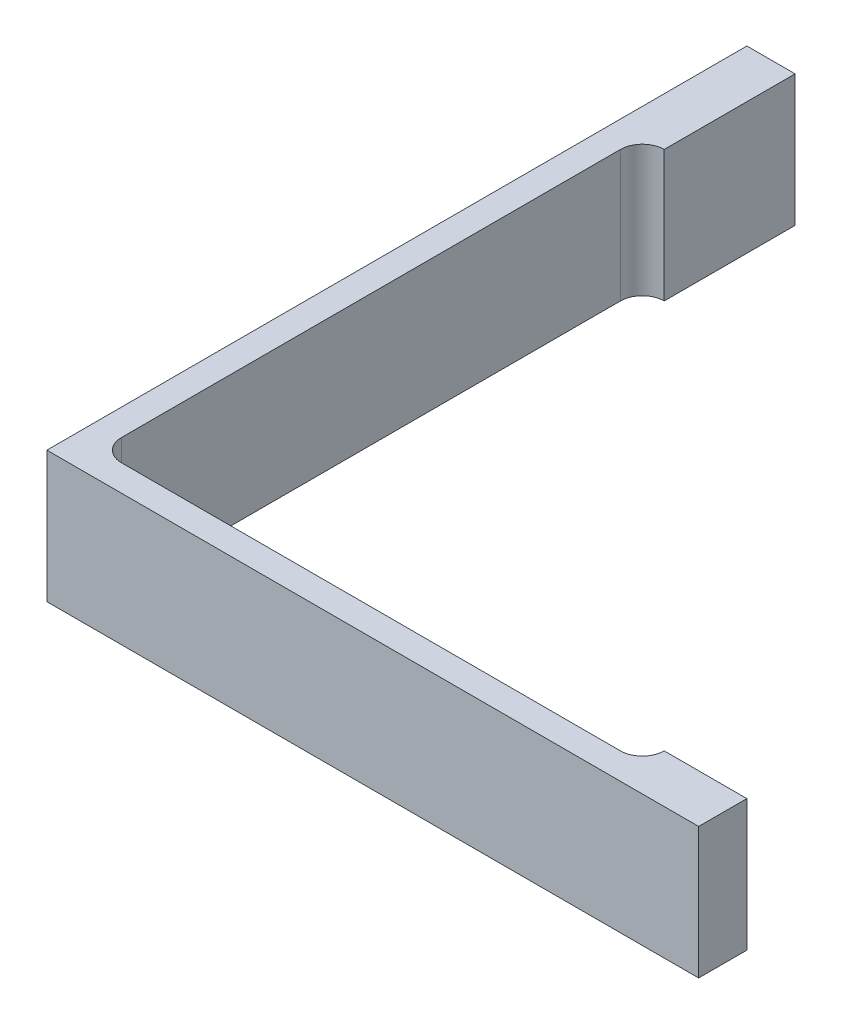
ISO-10303-21;
HEADER;
FILE_DESCRIPTION(('STEP AP214'),'2;1');
FILE_NAME('part.step','',(''),(''),'','','');
FILE_SCHEMA(('AUTOMOTIVE_DESIGN { 1 0 10303 214 1 1 1 1 }'));
ENDSEC;
DATA;
#1=APPLICATION_CONTEXT('core data for automotive mechanical design processes');
#2=APPLICATION_PROTOCOL_DEFINITION('international standard','automotive_design',2000,#1);
#3=PRODUCT_CONTEXT('',#1,'mechanical');
#4=PRODUCT('Part','Part','',(#3));
#5=PRODUCT_RELATED_PRODUCT_CATEGORY('part','',(#4));
#6=PRODUCT_DEFINITION_FORMATION('','',#4);
#7=PRODUCT_DEFINITION_CONTEXT('part definition',#1,'design');
#8=PRODUCT_DEFINITION('design','',#6,#7);
#9=PRODUCT_DEFINITION_SHAPE('','',#8);
#10=(LENGTH_UNIT() NAMED_UNIT(*) SI_UNIT(.MILLI.,.METRE.));
#11=(NAMED_UNIT(*) PLANE_ANGLE_UNIT() SI_UNIT($,.RADIAN.));
#12=(NAMED_UNIT(*) SI_UNIT($,.STERADIAN.) SOLID_ANGLE_UNIT());
#13=UNCERTAINTY_MEASURE_WITH_UNIT(LENGTH_MEASURE(1.E-05),#10,'distance_accuracy_value','');
#14=(GEOMETRIC_REPRESENTATION_CONTEXT(3) GLOBAL_UNCERTAINTY_ASSIGNED_CONTEXT((#13)) GLOBAL_UNIT_ASSIGNED_CONTEXT((#10,
#11,#12)) REPRESENTATION_CONTEXT('',''));
#15=CARTESIAN_POINT('',(0.,0.,0.));
#16=DIRECTION('',(0.,0.,1.));
#17=DIRECTION('',(1.,0.,0.));
#18=AXIS2_PLACEMENT_3D('',#15,#16,#17);
#19=CARTESIAN_POINT('',(47.3,9.525,0.));
#20=DIRECTION('',(0.,0.,-1.));
#21=DIRECTION('',(-1.,0.,0.));
#22=AXIS2_PLACEMENT_3D('',#19,#20,#21);
#23=PLANE('',#22);
#24=DIRECTION('',(1.,0.,0.));
#25=VECTOR('',#24,1.);
#26=CARTESIAN_POINT('',(47.3,0.,0.));
#27=LINE('',#26,#25);
#28=CARTESIAN_POINT('',(0.,0.,0.));
#29=VERTEX_POINT('',#28);
#30=CARTESIAN_POINT('',(47.3,0.,0.));
#31=VERTEX_POINT('',#30);
#32=EDGE_CURVE('E166',#29,#31,#27,.T.);
#33=ORIENTED_EDGE('',*,*,#32,.T.);
#34=DIRECTION('',(0.,-1.,0.));
#35=VECTOR('',#34,1.);
#36=CARTESIAN_POINT('',(47.3,9.525,0.));
#37=LINE('',#36,#35);
#38=CARTESIAN_POINT('',(47.3,9.525,0.));
#39=VERTEX_POINT('',#38);
#40=EDGE_CURVE('E200',#39,#31,#37,.T.);
#41=ORIENTED_EDGE('',*,*,#40,.F.);
#42=DIRECTION('',(1.,0.,0.));
#43=VECTOR('',#42,1.);
#44=CARTESIAN_POINT('',(47.3,9.525,0.));
#45=LINE('',#44,#43);
#46=CARTESIAN_POINT('',(0.,9.525,0.));
#47=VERTEX_POINT('',#46);
#48=EDGE_CURVE('E168',#47,#39,#45,.T.);
#49=ORIENTED_EDGE('',*,*,#48,.F.);
#50=DIRECTION('',(0.,-1.,0.));
#51=VECTOR('',#50,1.);
#52=CARTESIAN_POINT('',(0.,9.525,0.));
#53=LINE('',#52,#51);
#54=EDGE_CURVE('E181',#47,#29,#53,.T.);
#55=ORIENTED_EDGE('',*,*,#54,.T.);
#56=EDGE_LOOP('',(#33,#41,#49,#55));
#57=FACE_BOUND('',#56,.T.);
#58=ADVANCED_FACE('F34',(#57),#23,.F.);
#59=CARTESIAN_POINT('',(47.3,9.525,0.));
#60=DIRECTION('',(-1.,0.,0.));
#61=DIRECTION('',(0.,0.,1.));
#62=AXIS2_PLACEMENT_3D('',#59,#60,#61);
#63=PLANE('',#62);
#64=DIRECTION('',(0.,0.,-1.));
#65=VECTOR('',#64,1.);
#66=CARTESIAN_POINT('',(47.3,0.,0.));
#67=LINE('',#66,#65);
#68=CARTESIAN_POINT('',(47.3,0.,-3.49999999999999));
#69=VERTEX_POINT('',#68);
#70=EDGE_CURVE('E184',#31,#69,#67,.T.);
#71=ORIENTED_EDGE('',*,*,#70,.T.);
#72=DIRECTION('',(0.,-1.,0.));
#73=VECTOR('',#72,1.);
#74=CARTESIAN_POINT('',(47.3,9.525,-3.49999999999999));
#75=LINE('',#74,#73);
#76=CARTESIAN_POINT('',(47.3,9.525,-3.49999999999999));
#77=VERTEX_POINT('',#76);
#78=EDGE_CURVE('E197',#77,#69,#75,.T.);
#79=ORIENTED_EDGE('',*,*,#78,.F.);
#80=DIRECTION('',(0.,0.,-1.));
#81=VECTOR('',#80,1.);
#82=CARTESIAN_POINT('',(47.3,9.525,0.));
#83=LINE('',#82,#81);
#84=EDGE_CURVE('E171',#39,#77,#83,.T.);
#85=ORIENTED_EDGE('',*,*,#84,.F.);
#86=ORIENTED_EDGE('',*,*,#40,.T.);
#87=EDGE_LOOP('',(#71,#79,#85,#86));
#88=FACE_BOUND('',#87,.T.);
#89=ADVANCED_FACE('F229',(#88),#63,.F.);
#90=CARTESIAN_POINT('',(3.50000000000001,9.525,-3.49999999999999));
#91=DIRECTION('',(0.,0.,1.));
#92=DIRECTION('',(1.,0.,0.));
#93=AXIS2_PLACEMENT_3D('',#90,#91,#92);
#94=PLANE('',#93);
#95=DIRECTION('',(-1.,0.,0.));
#96=VECTOR('',#95,1.);
#97=CARTESIAN_POINT('',(3.50000000000001,0.,-3.49999999999999));
#98=LINE('',#97,#96);
#99=CARTESIAN_POINT('',(41.3,0.,-3.49999999999999));
#100=VERTEX_POINT('',#99);
#101=EDGE_CURVE('E132',#69,#100,#98,.T.);
#102=ORIENTED_EDGE('',*,*,#101,.T.);
#103=DIRECTION('',(0.,1.,0.));
#104=VECTOR('',#103,1.);
#105=CARTESIAN_POINT('',(41.3,0.,-3.49999999999999));
#106=LINE('',#105,#104);
#107=CARTESIAN_POINT('',(41.3,9.525,-3.49999999999999));
#108=VERTEX_POINT('',#107);
#109=EDGE_CURVE('E124',#100,#108,#106,.T.);
#110=ORIENTED_EDGE('',*,*,#109,.T.);
#111=DIRECTION('',(-1.,0.,0.));
#112=VECTOR('',#111,1.);
#113=CARTESIAN_POINT('',(3.50000000000001,9.525,-3.49999999999999));
#114=LINE('',#113,#112);
#115=EDGE_CURVE('E174',#77,#108,#114,.T.);
#116=ORIENTED_EDGE('',*,*,#115,.F.);
#117=ORIENTED_EDGE('',*,*,#78,.T.);
#118=EDGE_LOOP('',(#102,#110,#116,#117));
#119=FACE_BOUND('',#118,.T.);
#120=ADVANCED_FACE('F216',(#119),#94,.F.);
#121=CARTESIAN_POINT('',(3.5,9.525,-50.8));
#122=DIRECTION('',(-1.,0.,0.));
#123=DIRECTION('',(0.,0.,1.));
#124=AXIS2_PLACEMENT_3D('',#121,#122,#123);
#125=PLANE('',#124);
#126=DIRECTION('',(0.,0.,-1.));
#127=VECTOR('',#126,1.);
#128=CARTESIAN_POINT('',(3.5,9.525,-50.8));
#129=LINE('',#128,#127);
#130=CARTESIAN_POINT('',(3.50000000000001,9.525,-41.3));
#131=VERTEX_POINT('',#130);
#132=CARTESIAN_POINT('',(3.5,9.525,-50.8));
#133=VERTEX_POINT('',#132);
#134=EDGE_CURVE('E122',#131,#133,#129,.T.);
#135=ORIENTED_EDGE('',*,*,#134,.F.);
#136=DIRECTION('',(0.,1.,0.));
#137=VECTOR('',#136,1.);
#138=CARTESIAN_POINT('',(3.50000000000001,0.,-41.3));
#139=LINE('',#138,#137);
#140=CARTESIAN_POINT('',(3.50000000000001,0.,-41.3));
#141=VERTEX_POINT('',#140);
#142=EDGE_CURVE('E117',#141,#131,#139,.T.);
#143=ORIENTED_EDGE('',*,*,#142,.F.);
#144=DIRECTION('',(0.,0.,-1.));
#145=VECTOR('',#144,1.);
#146=CARTESIAN_POINT('',(3.5,0.,-50.8));
#147=LINE('',#146,#145);
#148=CARTESIAN_POINT('',(3.5,0.,-50.8));
#149=VERTEX_POINT('',#148);
#150=EDGE_CURVE('E120',#141,#149,#147,.T.);
#151=ORIENTED_EDGE('',*,*,#150,.T.);
#152=DIRECTION('',(0.,-1.,0.));
#153=VECTOR('',#152,1.);
#154=CARTESIAN_POINT('',(3.5,9.525,-50.8));
#155=LINE('',#154,#153);
#156=EDGE_CURVE('E195',#133,#149,#155,.T.);
#157=ORIENTED_EDGE('',*,*,#156,.F.);
#158=EDGE_LOOP('',(#135,#143,#151,#157));
#159=FACE_BOUND('',#158,.T.);
#160=ADVANCED_FACE('F118',(#159),#125,.F.);
#161=CARTESIAN_POINT('',(0.,9.525,-50.8));
#162=DIRECTION('',(0.,0.,1.));
#163=DIRECTION('',(1.,0.,0.));
#164=AXIS2_PLACEMENT_3D('',#161,#162,#163);
#165=PLANE('',#164);
#166=DIRECTION('',(-1.,0.,0.));
#167=VECTOR('',#166,1.);
#168=CARTESIAN_POINT('',(0.,0.,-50.8));
#169=LINE('',#168,#167);
#170=CARTESIAN_POINT('',(0.,0.,-50.8));
#171=VERTEX_POINT('',#170);
#172=EDGE_CURVE('E131',#149,#171,#169,.T.);
#173=ORIENTED_EDGE('',*,*,#172,.T.);
#174=DIRECTION('',(0.,-1.,0.));
#175=VECTOR('',#174,1.);
#176=CARTESIAN_POINT('',(0.,9.525,-50.8));
#177=LINE('',#176,#175);
#178=CARTESIAN_POINT('',(0.,9.525,-50.8));
#179=VERTEX_POINT('',#178);
#180=EDGE_CURVE('E192',#179,#171,#177,.T.);
#181=ORIENTED_EDGE('',*,*,#180,.F.);
#182=DIRECTION('',(-1.,0.,0.));
#183=VECTOR('',#182,1.);
#184=CARTESIAN_POINT('',(0.,9.525,-50.8));
#185=LINE('',#184,#183);
#186=EDGE_CURVE('E177',#133,#179,#185,.T.);
#187=ORIENTED_EDGE('',*,*,#186,.F.);
#188=ORIENTED_EDGE('',*,*,#156,.T.);
#189=EDGE_LOOP('',(#173,#181,#187,#188));
#190=FACE_BOUND('',#189,.T.);
#191=ADVANCED_FACE('F242',(#190),#165,.F.);
#192=CARTESIAN_POINT('',(0.,9.525,0.));
#193=DIRECTION('',(1.,0.,0.));
#194=DIRECTION('',(0.,0.,-1.));
#195=AXIS2_PLACEMENT_3D('',#192,#193,#194);
#196=PLANE('',#195);
#197=DIRECTION('',(0.,0.,1.));
#198=VECTOR('',#197,1.);
#199=CARTESIAN_POINT('',(0.,0.,0.));
#200=LINE('',#199,#198);
#201=EDGE_CURVE('E172',#171,#29,#200,.T.);
#202=ORIENTED_EDGE('',*,*,#201,.T.);
#203=ORIENTED_EDGE('',*,*,#54,.F.);
#204=DIRECTION('',(0.,0.,1.));
#205=VECTOR('',#204,1.);
#206=CARTESIAN_POINT('',(0.,9.525,0.));
#207=LINE('',#206,#205);
#208=EDGE_CURVE('E179',#179,#47,#207,.T.);
#209=ORIENTED_EDGE('',*,*,#208,.F.);
#210=ORIENTED_EDGE('',*,*,#180,.T.);
#211=EDGE_LOOP('',(#202,#203,#209,#210));
#212=FACE_BOUND('',#211,.T.);
#213=ADVANCED_FACE('F245',(#212),#196,.F.);
#214=CARTESIAN_POINT('',(0.,9.525,0.));
#215=DIRECTION('',(0.,-1.,0.));
#216=DIRECTION('',(0.,0.,-1.));
#217=AXIS2_PLACEMENT_3D('',#214,#215,#216);
#218=PLANE('',#217);
#219=ORIENTED_EDGE('',*,*,#115,.T.);
#220=CARTESIAN_POINT('',(39.7125,9.525,-3.49999999999999));
#221=DIRECTION('',(0.,-1.,0.));
#222=DIRECTION('',(0.,0.,-1.));
#223=AXIS2_PLACEMENT_3D('',#220,#221,#222);
#224=CIRCLE('',#223,1.5875);
#225=CARTESIAN_POINT('',(39.7125,9.525,-1.91249999999999));
#226=VERTEX_POINT('',#225);
#227=EDGE_CURVE('E140',#108,#226,#224,.T.);
#228=ORIENTED_EDGE('',*,*,#227,.T.);
#229=DIRECTION('',(1.,0.,0.));
#230=VECTOR('',#229,1.);
#231=CARTESIAN_POINT('',(1.91250000000001,9.525,-1.91249999999999));
#232=LINE('',#231,#230);
#233=CARTESIAN_POINT('',(3.5,9.525,-1.91249999999999));
#234=VERTEX_POINT('',#233);
#235=EDGE_CURVE('E157',#234,#226,#232,.T.);
#236=ORIENTED_EDGE('',*,*,#235,.F.);
#237=CARTESIAN_POINT('',(3.5,9.525,-3.49999999999999));
#238=DIRECTION('',(0.,-1.,0.));
#239=DIRECTION('',(0.,0.,-1.));
#240=AXIS2_PLACEMENT_3D('',#237,#238,#239);
#241=CIRCLE('',#240,1.5875);
#242=CARTESIAN_POINT('',(1.91250000000001,9.525,-3.49999999999999));
#243=VERTEX_POINT('',#242);
#244=EDGE_CURVE('E149',#234,#243,#241,.T.);
#245=ORIENTED_EDGE('',*,*,#244,.T.);
#246=DIRECTION('',(0.,0.,1.));
#247=VECTOR('',#246,1.);
#248=CARTESIAN_POINT('',(1.91250000000001,9.525,-3.5));
#249=LINE('',#248,#247);
#250=CARTESIAN_POINT('',(1.91250000000001,9.525,-39.7125));
#251=VERTEX_POINT('',#250);
#252=EDGE_CURVE('E155',#251,#243,#249,.T.);
#253=ORIENTED_EDGE('',*,*,#252,.F.);
#254=CARTESIAN_POINT('',(3.5,9.525,-39.7125));
#255=DIRECTION('',(0.,-1.,0.));
#256=DIRECTION('',(0.,0.,-1.));
#257=AXIS2_PLACEMENT_3D('',#254,#255,#256);
#258=CIRCLE('',#257,1.5875);
#259=EDGE_CURVE('E42',#251,#131,#258,.T.);
#260=ORIENTED_EDGE('',*,*,#259,.T.);
#261=ORIENTED_EDGE('',*,*,#134,.T.);
#262=ORIENTED_EDGE('',*,*,#186,.T.);
#263=ORIENTED_EDGE('',*,*,#208,.T.);
#264=ORIENTED_EDGE('',*,*,#48,.T.);
#265=ORIENTED_EDGE('',*,*,#84,.T.);
#266=EDGE_LOOP('',(#219,#228,#236,#245,#253,#260,#261,#262,#263,#264,#265));
#267=FACE_BOUND('',#266,.T.);
#268=ADVANCED_FACE('F154',(#267),#218,.F.);
#269=CARTESIAN_POINT('',(0.,0.,0.));
#270=DIRECTION('',(0.,-1.,0.));
#271=DIRECTION('',(0.,0.,-1.));
#272=AXIS2_PLACEMENT_3D('',#269,#270,#271);
#273=PLANE('',#272);
#274=DIRECTION('',(1.,0.,0.));
#275=VECTOR('',#274,1.);
#276=CARTESIAN_POINT('',(1.91250000000001,0.,-1.91249999999999));
#277=LINE('',#276,#275);
#278=CARTESIAN_POINT('',(3.5,0.,-1.91249999999999));
#279=VERTEX_POINT('',#278);
#280=CARTESIAN_POINT('',(39.7125,0.,-1.91249999999999));
#281=VERTEX_POINT('',#280);
#282=EDGE_CURVE('E125',#279,#281,#277,.T.);
#283=ORIENTED_EDGE('',*,*,#282,.T.);
#284=CARTESIAN_POINT('',(39.7125,0.,-3.49999999999999));
#285=DIRECTION('',(0.,-1.,0.));
#286=DIRECTION('',(0.,0.,-1.));
#287=AXIS2_PLACEMENT_3D('',#284,#285,#286);
#288=CIRCLE('',#287,1.5875);
#289=EDGE_CURVE('E147',#281,#100,#288,.F.);
#290=ORIENTED_EDGE('',*,*,#289,.T.);
#291=ORIENTED_EDGE('',*,*,#101,.F.);
#292=ORIENTED_EDGE('',*,*,#70,.F.);
#293=ORIENTED_EDGE('',*,*,#32,.F.);
#294=ORIENTED_EDGE('',*,*,#201,.F.);
#295=ORIENTED_EDGE('',*,*,#172,.F.);
#296=ORIENTED_EDGE('',*,*,#150,.F.);
#297=CARTESIAN_POINT('',(3.5,0.,-39.7125));
#298=DIRECTION('',(0.,-1.,0.));
#299=DIRECTION('',(0.,0.,-1.));
#300=AXIS2_PLACEMENT_3D('',#297,#298,#299);
#301=CIRCLE('',#300,1.5875);
#302=CARTESIAN_POINT('',(1.91250000000001,0.,-39.7125));
#303=VERTEX_POINT('',#302);
#304=EDGE_CURVE('E11',#141,#303,#301,.F.);
#305=ORIENTED_EDGE('',*,*,#304,.T.);
#306=DIRECTION('',(0.,0.,1.));
#307=VECTOR('',#306,1.);
#308=CARTESIAN_POINT('',(1.91250000000001,0.,-41.3));
#309=LINE('',#308,#307);
#310=CARTESIAN_POINT('',(1.91250000000001,0.,-3.5));
#311=VERTEX_POINT('',#310);
#312=EDGE_CURVE('E160',#303,#311,#309,.T.);
#313=ORIENTED_EDGE('',*,*,#312,.T.);
#314=CARTESIAN_POINT('',(3.5,0.,-3.49999999999999));
#315=DIRECTION('',(0.,-1.,0.));
#316=DIRECTION('',(0.,0.,-1.));
#317=AXIS2_PLACEMENT_3D('',#314,#315,#316);
#318=CIRCLE('',#317,1.5875);
#319=EDGE_CURVE('E151',#311,#279,#318,.F.);
#320=ORIENTED_EDGE('',*,*,#319,.T.);
#321=EDGE_LOOP('',(#283,#290,#291,#292,#293,#294,#295,#296,#305,#313,#320));
#322=FACE_BOUND('',#321,.T.);
#323=ADVANCED_FACE('F129',(#322),#273,.T.);
#324=CARTESIAN_POINT('',(1.91250000000001,0.,-1.91249999999999));
#325=DIRECTION('',(0.,0.,1.));
#326=DIRECTION('',(1.,0.,0.));
#327=AXIS2_PLACEMENT_3D('',#324,#325,#326);
#328=PLANE('',#327);
#329=ORIENTED_EDGE('',*,*,#235,.T.);
#330=DIRECTION('',(0.,1.,0.));
#331=VECTOR('',#330,1.);
#332=CARTESIAN_POINT('',(39.7125,0.,-1.91249999999999));
#333=LINE('',#332,#331);
#334=EDGE_CURVE('E138',#226,#281,#333,.F.);
#335=ORIENTED_EDGE('',*,*,#334,.T.);
#336=ORIENTED_EDGE('',*,*,#282,.F.);
#337=DIRECTION('',(0.,1.,0.));
#338=VECTOR('',#337,1.);
#339=CARTESIAN_POINT('',(3.5,9.525,-1.9125));
#340=LINE('',#339,#338);
#341=EDGE_CURVE('E142',#279,#234,#340,.T.);
#342=ORIENTED_EDGE('',*,*,#341,.T.);
#343=EDGE_LOOP('',(#329,#335,#336,#342));
#344=FACE_BOUND('',#343,.T.);
#345=ADVANCED_FACE('F206',(#344),#328,.F.);
#346=CARTESIAN_POINT('',(1.91250000000001,0.,-3.5));
#347=DIRECTION('',(-1.,0.,0.));
#348=DIRECTION('',(0.,0.,1.));
#349=AXIS2_PLACEMENT_3D('',#346,#347,#348);
#350=PLANE('',#349);
#351=ORIENTED_EDGE('',*,*,#252,.T.);
#352=DIRECTION('',(0.,1.,0.));
#353=VECTOR('',#352,1.);
#354=CARTESIAN_POINT('',(1.91250000000001,0.,-3.49999999999999));
#355=LINE('',#354,#353);
#356=EDGE_CURVE('E49',#243,#311,#355,.F.);
#357=ORIENTED_EDGE('',*,*,#356,.T.);
#358=ORIENTED_EDGE('',*,*,#312,.F.);
#359=DIRECTION('',(0.,1.,0.));
#360=VECTOR('',#359,1.);
#361=CARTESIAN_POINT('',(1.91250000000001,9.525,-39.7125));
#362=LINE('',#361,#360);
#363=EDGE_CURVE('E136',#303,#251,#362,.T.);
#364=ORIENTED_EDGE('',*,*,#363,.T.);
#365=EDGE_LOOP('',(#351,#357,#358,#364));
#366=FACE_BOUND('',#365,.T.);
#367=ADVANCED_FACE('F226',(#366),#350,.F.);
#368=CARTESIAN_POINT('',(39.7125,0.,-3.49999999999999));
#369=DIRECTION('',(0.,-1.,0.));
#370=DIRECTION('',(0.,0.,-1.));
#371=AXIS2_PLACEMENT_3D('',#368,#369,#370);
#372=CYLINDRICAL_SURFACE('',#371,1.5875);
#373=ORIENTED_EDGE('',*,*,#289,.F.);
#374=ORIENTED_EDGE('',*,*,#334,.F.);
#375=ORIENTED_EDGE('',*,*,#227,.F.);
#376=ORIENTED_EDGE('',*,*,#109,.F.);
#377=EDGE_LOOP('',(#373,#374,#375,#376));
#378=FACE_BOUND('',#377,.T.);
#379=ADVANCED_FACE('F214',(#378),#372,.F.);
#380=CARTESIAN_POINT('',(3.5,0.,-3.49999999999999));
#381=DIRECTION('',(0.,-1.,0.));
#382=DIRECTION('',(0.,0.,-1.));
#383=AXIS2_PLACEMENT_3D('',#380,#381,#382);
#384=CYLINDRICAL_SURFACE('',#383,1.5875);
#385=ORIENTED_EDGE('',*,*,#319,.F.);
#386=ORIENTED_EDGE('',*,*,#356,.F.);
#387=ORIENTED_EDGE('',*,*,#244,.F.);
#388=ORIENTED_EDGE('',*,*,#341,.F.);
#389=EDGE_LOOP('',(#385,#386,#387,#388));
#390=FACE_BOUND('',#389,.T.);
#391=ADVANCED_FACE('F220',(#390),#384,.F.);
#392=CARTESIAN_POINT('',(3.5,0.,-39.7125));
#393=DIRECTION('',(0.,-1.,0.));
#394=DIRECTION('',(0.,0.,-1.));
#395=AXIS2_PLACEMENT_3D('',#392,#393,#394);
#396=CYLINDRICAL_SURFACE('',#395,1.5875);
#397=ORIENTED_EDGE('',*,*,#304,.F.);
#398=ORIENTED_EDGE('',*,*,#142,.T.);
#399=ORIENTED_EDGE('',*,*,#259,.F.);
#400=ORIENTED_EDGE('',*,*,#363,.F.);
#401=EDGE_LOOP('',(#397,#398,#399,#400));
#402=FACE_BOUND('',#401,.T.);
#403=ADVANCED_FACE('F36',(#402),#396,.F.);
#404=CLOSED_SHELL('',(#58,#89,#120,#160,#191,#213,#268,#323,#345,#367,#379,#391,#403));
#405=MANIFOLD_SOLID_BREP('B2',#404);
#406=ADVANCED_BREP_SHAPE_REPRESENTATION('',(#18,#405),#14);
#407=SHAPE_DEFINITION_REPRESENTATION(#9,#406);
ENDSEC;
END-ISO-10303-21;
